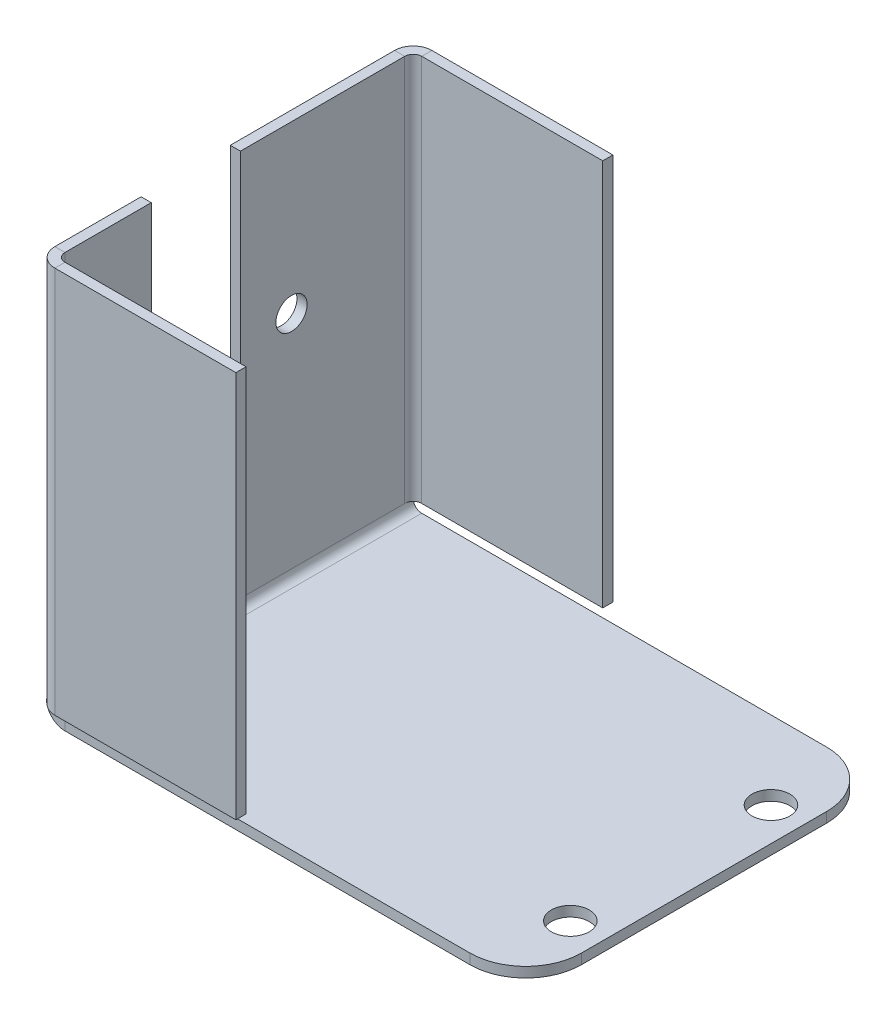
ISO-10303-21;
HEADER;
FILE_DESCRIPTION(('STEP AP214'),'2;1');
FILE_NAME('part.step','',(''),(''),'','','');
FILE_SCHEMA(('AUTOMOTIVE_DESIGN { 1 0 10303 214 1 1 1 1 }'));
ENDSEC;
DATA;
#1=APPLICATION_CONTEXT('core data for automotive mechanical design processes');
#2=APPLICATION_PROTOCOL_DEFINITION('international standard','automotive_design',2000,#1);
#3=PRODUCT_CONTEXT('',#1,'mechanical');
#4=PRODUCT('Part','Part','',(#3));
#5=PRODUCT_RELATED_PRODUCT_CATEGORY('part','',(#4));
#6=PRODUCT_DEFINITION_FORMATION('','',#4);
#7=PRODUCT_DEFINITION_CONTEXT('part definition',#1,'design');
#8=PRODUCT_DEFINITION('design','',#6,#7);
#9=PRODUCT_DEFINITION_SHAPE('','',#8);
#10=(LENGTH_UNIT() NAMED_UNIT(*) SI_UNIT(.MILLI.,.METRE.));
#11=(NAMED_UNIT(*) PLANE_ANGLE_UNIT() SI_UNIT($,.RADIAN.));
#12=(NAMED_UNIT(*) SI_UNIT($,.STERADIAN.) SOLID_ANGLE_UNIT());
#13=UNCERTAINTY_MEASURE_WITH_UNIT(LENGTH_MEASURE(1.E-05),#10,'distance_accuracy_value','');
#14=(GEOMETRIC_REPRESENTATION_CONTEXT(3) GLOBAL_UNCERTAINTY_ASSIGNED_CONTEXT((#13)) GLOBAL_UNIT_ASSIGNED_CONTEXT((#10,
#11,#12)) REPRESENTATION_CONTEXT('',''));
#15=CARTESIAN_POINT('',(0.,0.,0.));
#16=DIRECTION('',(0.,0.,1.));
#17=DIRECTION('',(1.,0.,0.));
#18=AXIS2_PLACEMENT_3D('',#15,#16,#17);
#19=CARTESIAN_POINT('',(0.,0.,0.));
#20=DIRECTION('',(1.,0.,0.));
#21=DIRECTION('',(0.,1.,0.));
#22=AXIS2_PLACEMENT_3D('',#19,#20,#21);
#23=PLANE('',#22);
#24=CARTESIAN_POINT('',(0.,20.6,-21.08));
#25=DIRECTION('',(-1.,0.,0.));
#26=DIRECTION('',(0.,-1.,0.));
#27=AXIS2_PLACEMENT_3D('',#24,#25,#26);
#28=CIRCLE('',#27,1.4);
#29=CARTESIAN_POINT('',(0.,19.2,-21.08));
#30=VERTEX_POINT('',#29);
#31=EDGE_CURVE('E400',#30,#30,#28,.T.);
#32=ORIENTED_EDGE('',*,*,#31,.F.);
#33=EDGE_LOOP('',(#32));
#34=FACE_BOUND('',#33,.T.);
#35=CARTESIAN_POINT('',(0.,7.22999999999999,-7.1));
#36=DIRECTION('',(-1.,0.,0.));
#37=DIRECTION('',(0.,-1.,0.));
#38=AXIS2_PLACEMENT_3D('',#35,#36,#37);
#39=CIRCLE('',#38,1.4);
#40=CARTESIAN_POINT('',(0.,5.82999999999999,-7.1));
#41=VERTEX_POINT('',#40);
#42=EDGE_CURVE('E391',#41,#41,#39,.T.);
#43=ORIENTED_EDGE('',*,*,#42,.F.);
#44=EDGE_LOOP('',(#43));
#45=FACE_BOUND('',#44,.T.);
#46=DIRECTION('',(0.,1.,0.));
#47=VECTOR('',#46,1.);
#48=CARTESIAN_POINT('',(0.,0.,-8.5));
#49=LINE('',#48,#47);
#50=CARTESIAN_POINT('',(-1.23947587528931E-13,35.5,-8.5));
#51=VERTEX_POINT('',#50);
#52=CARTESIAN_POINT('',(0.,15.,-8.5));
#53=VERTEX_POINT('',#52);
#54=EDGE_CURVE('E229',#51,#53,#49,.F.);
#55=ORIENTED_EDGE('',*,*,#54,.T.);
#56=CARTESIAN_POINT('',(0.,15.,-12.5));
#57=DIRECTION('',(-1.,0.,0.));
#58=DIRECTION('',(0.,-1.,0.));
#59=AXIS2_PLACEMENT_3D('',#56,#57,#58);
#60=CIRCLE('',#59,4.);
#61=CARTESIAN_POINT('',(0.,15.,-16.5));
#62=VERTEX_POINT('',#61);
#63=EDGE_CURVE('E244',#62,#53,#60,.T.);
#64=ORIENTED_EDGE('',*,*,#63,.F.);
#65=DIRECTION('',(0.,1.,0.));
#66=VECTOR('',#65,1.);
#67=CARTESIAN_POINT('',(0.,0.,-16.5));
#68=LINE('',#67,#66);
#69=CARTESIAN_POINT('',(-1.23947587528931E-13,35.5,-16.5));
#70=VERTEX_POINT('',#69);
#71=EDGE_CURVE('E247',#62,#70,#68,.T.);
#72=ORIENTED_EDGE('',*,*,#71,.T.);
#73=DIRECTION('',(0.,0.,-1.));
#74=VECTOR('',#73,1.);
#75=CARTESIAN_POINT('',(-1.23947587528931E-13,35.5,0.));
#76=LINE('',#75,#74);
#77=CARTESIAN_POINT('',(-1.23947587528931E-13,35.5,-31.238));
#78=VERTEX_POINT('',#77);
#79=EDGE_CURVE('E317',#70,#78,#76,.T.);
#80=ORIENTED_EDGE('',*,*,#79,.T.);
#81=DIRECTION('',(0.,1.,0.));
#82=VECTOR('',#81,1.);
#83=CARTESIAN_POINT('',(0.,35.5,-31.238));
#84=LINE('',#83,#82);
#85=CARTESIAN_POINT('',(0.,0.761999999999994,-31.238));
#86=VERTEX_POINT('',#85);
#87=EDGE_CURVE('E460',#78,#86,#84,.F.);
#88=ORIENTED_EDGE('',*,*,#87,.T.);
#89=DIRECTION('',(0.,0.,1.));
#90=VECTOR('',#89,1.);
#91=CARTESIAN_POINT('',(0.,0.761999999999994,-32.));
#92=LINE('',#91,#90);
#93=CARTESIAN_POINT('',(0.,0.761999999999994,-0.761999999999999));
#94=VERTEX_POINT('',#93);
#95=EDGE_CURVE('E325',#94,#86,#92,.F.);
#96=ORIENTED_EDGE('',*,*,#95,.F.);
#97=DIRECTION('',(0.,-1.,0.));
#98=VECTOR('',#97,1.);
#99=CARTESIAN_POINT('',(0.,0.761999999999996,-0.761999999999997));
#100=LINE('',#99,#98);
#101=CARTESIAN_POINT('',(-1.23924308315093E-13,35.5,-0.761999999999997));
#102=VERTEX_POINT('',#101);
#103=EDGE_CURVE('E291',#94,#102,#100,.F.);
#104=ORIENTED_EDGE('',*,*,#103,.T.);
#105=EDGE_CURVE('E246',#102,#51,#76,.T.);
#106=ORIENTED_EDGE('',*,*,#105,.T.);
#107=EDGE_LOOP('',(#55,#64,#72,#80,#88,#96,#104,#106));
#108=FACE_BOUND('',#107,.T.);
#109=ADVANCED_FACE('F58',(#34,#45,#108),#23,.F.);
#110=CARTESIAN_POINT('',(0.91,0.,0.));
#111=DIRECTION('',(1.,0.,0.));
#112=DIRECTION('',(0.,1.,0.));
#113=AXIS2_PLACEMENT_3D('',#110,#111,#112);
#114=PLANE('',#113);
#115=CARTESIAN_POINT('',(0.909999999999928,20.6,-21.08));
#116=DIRECTION('',(1.,0.,0.));
#117=DIRECTION('',(0.,1.,0.));
#118=AXIS2_PLACEMENT_3D('',#115,#116,#117);
#119=CIRCLE('',#118,1.4);
#120=CARTESIAN_POINT('',(0.909999999999923,22.,-21.08));
#121=VERTEX_POINT('',#120);
#122=EDGE_CURVE('E62',#121,#121,#119,.T.);
#123=ORIENTED_EDGE('',*,*,#122,.F.);
#124=EDGE_LOOP('',(#123));
#125=FACE_BOUND('',#124,.T.);
#126=CARTESIAN_POINT('',(0.909999999999973,7.23,-7.1));
#127=DIRECTION('',(1.,0.,0.));
#128=DIRECTION('',(0.,1.,0.));
#129=AXIS2_PLACEMENT_3D('',#126,#127,#128);
#130=CIRCLE('',#129,1.4);
#131=CARTESIAN_POINT('',(0.909999999999969,8.63,-7.1));
#132=VERTEX_POINT('',#131);
#133=EDGE_CURVE('E388',#132,#132,#130,.T.);
#134=ORIENTED_EDGE('',*,*,#133,.F.);
#135=EDGE_LOOP('',(#134));
#136=FACE_BOUND('',#135,.T.);
#137=CARTESIAN_POINT('',(0.909999999999947,15.,-12.5));
#138=DIRECTION('',(1.,0.,0.));
#139=DIRECTION('',(0.,1.,0.));
#140=AXIS2_PLACEMENT_3D('',#137,#138,#139);
#141=CIRCLE('',#140,4.);
#142=CARTESIAN_POINT('',(0.909999999999947,15.,-16.5));
#143=VERTEX_POINT('',#142);
#144=CARTESIAN_POINT('',(0.909999999999947,15.,-8.5));
#145=VERTEX_POINT('',#144);
#146=EDGE_CURVE('E251',#143,#145,#141,.F.);
#147=ORIENTED_EDGE('',*,*,#146,.T.);
#148=DIRECTION('',(0.,-1.,0.));
#149=VECTOR('',#148,1.);
#150=CARTESIAN_POINT('',(0.91,0.,-8.49999999999999));
#151=LINE('',#150,#149);
#152=CARTESIAN_POINT('',(0.909999999999876,35.5,-8.5));
#153=VERTEX_POINT('',#152);
#154=EDGE_CURVE('E232',#153,#145,#151,.T.);
#155=ORIENTED_EDGE('',*,*,#154,.F.);
#156=DIRECTION('',(0.,0.,1.));
#157=VECTOR('',#156,1.);
#158=CARTESIAN_POINT('',(0.909999999999876,35.5,-32.));
#159=LINE('',#158,#157);
#160=CARTESIAN_POINT('',(0.909999999999876,35.5,-0.761999999999999));
#161=VERTEX_POINT('',#160);
#162=EDGE_CURVE('E318',#161,#153,#159,.F.);
#163=ORIENTED_EDGE('',*,*,#162,.F.);
#164=DIRECTION('',(0.,-1.,0.));
#165=VECTOR('',#164,1.);
#166=CARTESIAN_POINT('',(0.909999999999993,0.762,-0.761999999999997));
#167=LINE('',#166,#165);
#168=CARTESIAN_POINT('',(0.909999999999993,0.762000000000031,-0.761999999999997));
#169=VERTEX_POINT('',#168);
#170=EDGE_CURVE('E304',#169,#161,#167,.F.);
#171=ORIENTED_EDGE('',*,*,#170,.F.);
#172=DIRECTION('',(0.,0.,1.));
#173=VECTOR('',#172,1.);
#174=CARTESIAN_POINT('',(0.909999999999997,0.761999999999997,-32.));
#175=LINE('',#174,#173);
#176=CARTESIAN_POINT('',(0.909999999999997,0.761999999999997,-31.238));
#177=VERTEX_POINT('',#176);
#178=EDGE_CURVE('E333',#177,#169,#175,.T.);
#179=ORIENTED_EDGE('',*,*,#178,.F.);
#180=DIRECTION('',(0.,1.,0.));
#181=VECTOR('',#180,1.);
#182=CARTESIAN_POINT('',(0.90999999999993,35.5,-31.238));
#183=LINE('',#182,#181);
#184=CARTESIAN_POINT('',(0.909999999999876,35.5,-31.238));
#185=VERTEX_POINT('',#184);
#186=EDGE_CURVE('E472',#185,#177,#183,.F.);
#187=ORIENTED_EDGE('',*,*,#186,.F.);
#188=CARTESIAN_POINT('',(0.909999999999876,35.5,-16.5));
#189=VERTEX_POINT('',#188);
#190=EDGE_CURVE('E321',#189,#185,#159,.F.);
#191=ORIENTED_EDGE('',*,*,#190,.F.);
#192=DIRECTION('',(0.,1.,0.));
#193=VECTOR('',#192,1.);
#194=CARTESIAN_POINT('',(0.91,0.,-16.5));
#195=LINE('',#194,#193);
#196=EDGE_CURVE('E390',#143,#189,#195,.T.);
#197=ORIENTED_EDGE('',*,*,#196,.F.);
#198=EDGE_LOOP('',(#147,#155,#163,#171,#179,#187,#191,#197));
#199=FACE_BOUND('',#198,.T.);
#200=ADVANCED_FACE('F530',(#125,#136,#199),#114,.T.);
#201=CARTESIAN_POINT('',(-1.23924308315093E-13,35.5,-32.));
#202=DIRECTION('',(0.,-1.,0.));
#203=DIRECTION('',(1.,0.,0.));
#204=AXIS2_PLACEMENT_3D('',#201,#202,#203);
#205=PLANE('',#204);
#206=DIRECTION('',(1.,0.,0.));
#207=VECTOR('',#206,1.);
#208=CARTESIAN_POINT('',(0.909999999999876,35.5,-8.5));
#209=LINE('',#208,#207);
#210=EDGE_CURVE('E237',#153,#51,#209,.F.);
#211=ORIENTED_EDGE('',*,*,#210,.T.);
#212=ORIENTED_EDGE('',*,*,#105,.F.);
#213=DIRECTION('',(-1.,0.,0.));
#214=VECTOR('',#213,1.);
#215=CARTESIAN_POINT('',(0.909999999999875,35.5,-0.761999999999997));
#216=LINE('',#215,#214);
#217=EDGE_CURVE('E297',#161,#102,#216,.T.);
#218=ORIENTED_EDGE('',*,*,#217,.F.);
#219=ORIENTED_EDGE('',*,*,#162,.T.);
#220=EDGE_LOOP('',(#211,#212,#218,#219));
#221=FACE_BOUND('',#220,.T.);
#222=ADVANCED_FACE('F536',(#221),#205,.F.);
#223=DIRECTION('',(1.,0.,0.));
#224=VECTOR('',#223,1.);
#225=CARTESIAN_POINT('',(0.909999999999876,35.5,-16.5));
#226=LINE('',#225,#224);
#227=EDGE_CURVE('E406',#189,#70,#226,.F.);
#228=ORIENTED_EDGE('',*,*,#227,.F.);
#229=ORIENTED_EDGE('',*,*,#190,.T.);
#230=DIRECTION('',(-1.,0.,0.));
#231=VECTOR('',#230,1.);
#232=CARTESIAN_POINT('',(0.90999999999993,35.5,-31.238));
#233=LINE('',#232,#231);
#234=EDGE_CURVE('E257',#185,#78,#233,.T.);
#235=ORIENTED_EDGE('',*,*,#234,.T.);
#236=ORIENTED_EDGE('',*,*,#79,.F.);
#237=EDGE_LOOP('',(#228,#229,#235,#236));
#238=FACE_BOUND('',#237,.T.);
#239=ADVANCED_FACE('F482',(#238),#205,.F.);
#240=CARTESIAN_POINT('',(12.2237084989847,15.,-12.5));
#241=DIRECTION('',(-1.,0.,0.));
#242=DIRECTION('',(0.,-1.,0.));
#243=AXIS2_PLACEMENT_3D('',#240,#241,#242);
#244=CYLINDRICAL_SURFACE('',#243,4.);
#245=DIRECTION('',(1.,0.,0.));
#246=VECTOR('',#245,1.);
#247=CARTESIAN_POINT('',(0.909999999999947,15.,-8.5));
#248=LINE('',#247,#246);
#249=EDGE_CURVE('E226',#145,#53,#248,.F.);
#250=ORIENTED_EDGE('',*,*,#249,.F.);
#251=ORIENTED_EDGE('',*,*,#146,.F.);
#252=DIRECTION('',(1.,0.,0.));
#253=VECTOR('',#252,1.);
#254=CARTESIAN_POINT('',(0.909999999999947,15.,-16.5));
#255=LINE('',#254,#253);
#256=EDGE_CURVE('E238',#143,#62,#255,.F.);
#257=ORIENTED_EDGE('',*,*,#256,.T.);
#258=ORIENTED_EDGE('',*,*,#63,.T.);
#259=EDGE_LOOP('',(#250,#251,#257,#258));
#260=FACE_BOUND('',#259,.T.);
#261=ADVANCED_FACE('F250',(#260),#244,.F.);
#262=CARTESIAN_POINT('',(0.910000000000048,0.761999999999999,-31.238));
#263=DIRECTION('',(0.,1.,0.));
#264=DIRECTION('',(-1.,0.,0.));
#265=AXIS2_PLACEMENT_3D('',#262,#263,#264);
#266=PLANE('',#265);
#267=DIRECTION('',(0.,0.,1.));
#268=VECTOR('',#267,1.);
#269=CARTESIAN_POINT('',(0.,0.762000000000067,0.));
#270=LINE('',#269,#268);
#271=CARTESIAN_POINT('',(-1.23924308315093E-13,0.761999999999994,-32.));
#272=VERTEX_POINT('',#271);
#273=EDGE_CURVE('E252',#86,#272,#270,.F.);
#274=ORIENTED_EDGE('',*,*,#273,.F.);
#275=CARTESIAN_POINT('',(1.67200000000005,0.761999999999999,-31.238));
#276=DIRECTION('',(0.,1.,0.));
#277=DIRECTION('',(-1.,0.,0.));
#278=AXIS2_PLACEMENT_3D('',#275,#276,#277);
#279=CIRCLE('',#278,1.672);
#280=CARTESIAN_POINT('',(0.183732550917051,0.761999999999994,-32.));
#281=VERTEX_POINT('',#280);
#282=EDGE_CURVE('E464',#86,#281,#279,.F.);
#283=ORIENTED_EDGE('',*,*,#282,.T.);
#284=DIRECTION('',(1.,0.,0.));
#285=VECTOR('',#284,1.);
#286=CARTESIAN_POINT('',(0.,0.761999999999994,-32.));
#287=LINE('',#286,#285);
#288=EDGE_CURVE('E314',#281,#272,#287,.F.);
#289=ORIENTED_EDGE('',*,*,#288,.T.);
#290=EDGE_LOOP('',(#274,#283,#289));
#291=FACE_BOUND('',#290,.T.);
#292=ADVANCED_FACE('F612',(#291),#266,.T.);
#293=CARTESIAN_POINT('',(0.909999999999997,0.761999999999997,0.));
#294=DIRECTION('',(0.,1.,0.));
#295=DIRECTION('',(0.,0.,1.));
#296=AXIS2_PLACEMENT_3D('',#293,#294,#295);
#297=PLANE('',#296);
#298=DIRECTION('',(1.,0.,0.));
#299=VECTOR('',#298,1.);
#300=CARTESIAN_POINT('',(0.909999999999997,0.761999999999997,0.));
#301=LINE('',#300,#299);
#302=CARTESIAN_POINT('',(0.183732550916999,0.761999999999995,0.));
#303=VERTEX_POINT('',#302);
#304=CARTESIAN_POINT('',(0.,0.761999999999994,0.));
#305=VERTEX_POINT('',#304);
#306=EDGE_CURVE('E329',#303,#305,#301,.F.);
#307=ORIENTED_EDGE('',*,*,#306,.F.);
#308=CARTESIAN_POINT('',(1.67199999999999,0.762000000000034,-0.761999999999997));
#309=DIRECTION('',(0.,-1.,0.));
#310=DIRECTION('',(1.,0.,0.));
#311=AXIS2_PLACEMENT_3D('',#308,#309,#310);
#312=CIRCLE('',#311,1.672);
#313=EDGE_CURVE('E301',#303,#94,#312,.T.);
#314=ORIENTED_EDGE('',*,*,#313,.T.);
#315=EDGE_CURVE('E322',#305,#94,#92,.F.);
#316=ORIENTED_EDGE('',*,*,#315,.F.);
#317=EDGE_LOOP('',(#307,#314,#316));
#318=FACE_BOUND('',#317,.T.);
#319=ADVANCED_FACE('F542',(#318),#297,.T.);
#320=CARTESIAN_POINT('',(0.,-0.91,0.));
#321=DIRECTION('',(0.,0.,1.));
#322=DIRECTION('',(1.,0.,0.));
#323=AXIS2_PLACEMENT_3D('',#320,#321,#322);
#324=PLANE('',#323);
#325=DIRECTION('',(1.,0.,0.));
#326=VECTOR('',#325,1.);
#327=CARTESIAN_POINT('',(0.,-0.91,0.));
#328=LINE('',#327,#326);
#329=CARTESIAN_POINT('',(1.672,-0.91,0.));
#330=VERTEX_POINT('',#329);
#331=CARTESIAN_POINT('',(38.,-0.91,0.));
#332=VERTEX_POINT('',#331);
#333=EDGE_CURVE('E361',#330,#332,#328,.T.);
#334=ORIENTED_EDGE('',*,*,#333,.T.);
#335=DIRECTION('',(0.,1.,0.));
#336=VECTOR('',#335,1.);
#337=CARTESIAN_POINT('',(38.,-0.91,0.));
#338=LINE('',#337,#336);
#339=CARTESIAN_POINT('',(38.,0.,0.));
#340=VERTEX_POINT('',#339);
#341=EDGE_CURVE('E375',#332,#340,#338,.T.);
#342=ORIENTED_EDGE('',*,*,#341,.T.);
#343=DIRECTION('',(1.,0.,0.));
#344=VECTOR('',#343,1.);
#345=CARTESIAN_POINT('',(0.,0.,0.));
#346=LINE('',#345,#344);
#347=CARTESIAN_POINT('',(1.672,0.,0.));
#348=VERTEX_POINT('',#347);
#349=EDGE_CURVE('E358',#348,#340,#346,.T.);
#350=ORIENTED_EDGE('',*,*,#349,.F.);
#351=DIRECTION('',(0.,-1.,0.));
#352=VECTOR('',#351,1.);
#353=CARTESIAN_POINT('',(1.672,0.,0.));
#354=LINE('',#353,#352);
#355=EDGE_CURVE('E344',#348,#330,#354,.T.);
#356=ORIENTED_EDGE('',*,*,#355,.T.);
#357=EDGE_LOOP('',(#334,#342,#350,#356));
#358=FACE_BOUND('',#357,.T.);
#359=ADVANCED_FACE('F570',(#358),#324,.T.);
#360=CARTESIAN_POINT('',(0.,-0.91,0.));
#361=DIRECTION('',(0.,-1.,0.));
#362=DIRECTION('',(0.,0.,-1.));
#363=AXIS2_PLACEMENT_3D('',#360,#361,#362);
#364=PLANE('',#363);
#365=CARTESIAN_POINT('',(40.,-0.91,-7.));
#366=DIRECTION('',(0.,-1.,0.));
#367=DIRECTION('',(0.,0.,-1.));
#368=AXIS2_PLACEMENT_3D('',#365,#366,#367);
#369=CIRCLE('',#368,1.69999999999999);
#370=CARTESIAN_POINT('',(40.,-0.91,-8.69999999999999));
#371=VERTEX_POINT('',#370);
#372=EDGE_CURVE('E412',#371,#371,#369,.T.);
#373=ORIENTED_EDGE('',*,*,#372,.F.);
#374=EDGE_LOOP('',(#373));
#375=FACE_BOUND('',#374,.T.);
#376=CARTESIAN_POINT('',(4.672,-0.91,-3.));
#377=DIRECTION('',(0.,-1.,0.));
#378=DIRECTION('',(0.,0.,-1.));
#379=AXIS2_PLACEMENT_3D('',#376,#377,#378);
#380=CIRCLE('',#379,1.69999999999999);
#381=CARTESIAN_POINT('',(4.672,-0.91,-4.69999999999999));
#382=VERTEX_POINT('',#381);
#383=EDGE_CURVE('E418',#382,#382,#380,.T.);
#384=ORIENTED_EDGE('',*,*,#383,.F.);
#385=EDGE_LOOP('',(#384));
#386=FACE_BOUND('',#385,.T.);
#387=CARTESIAN_POINT('',(40.,-0.91,-25.));
#388=DIRECTION('',(0.,-1.,0.));
#389=DIRECTION('',(0.,0.,-1.));
#390=AXIS2_PLACEMENT_3D('',#387,#388,#389);
#391=CIRCLE('',#390,1.69999999999999);
#392=CARTESIAN_POINT('',(40.,-0.91,-26.7));
#393=VERTEX_POINT('',#392);
#394=EDGE_CURVE('E424',#393,#393,#391,.T.);
#395=ORIENTED_EDGE('',*,*,#394,.F.);
#396=EDGE_LOOP('',(#395));
#397=FACE_BOUND('',#396,.T.);
#398=DIRECTION('',(0.,0.,-1.));
#399=VECTOR('',#398,1.);
#400=CARTESIAN_POINT('',(43.,-0.91,0.));
#401=LINE('',#400,#399);
#402=CARTESIAN_POINT('',(43.,-0.91,-5.));
#403=VERTEX_POINT('',#402);
#404=CARTESIAN_POINT('',(43.,-0.91,-27.));
#405=VERTEX_POINT('',#404);
#406=EDGE_CURVE('E364',#403,#405,#401,.T.);
#407=ORIENTED_EDGE('',*,*,#406,.F.);
#408=CARTESIAN_POINT('',(38.,-0.91,-5.));
#409=DIRECTION('',(0.,-1.,0.));
#410=DIRECTION('',(0.,0.,-1.));
#411=AXIS2_PLACEMENT_3D('',#408,#409,#410);
#412=CIRCLE('',#411,5.);
#413=EDGE_CURVE('E67',#403,#332,#412,.T.);
#414=ORIENTED_EDGE('',*,*,#413,.T.);
#415=ORIENTED_EDGE('',*,*,#333,.F.);
#416=DIRECTION('',(0.,0.,1.));
#417=VECTOR('',#416,1.);
#418=CARTESIAN_POINT('',(1.672,-0.91,0.));
#419=LINE('',#418,#417);
#420=CARTESIAN_POINT('',(1.672,-0.91,-32.));
#421=VERTEX_POINT('',#420);
#422=EDGE_CURVE('E337',#330,#421,#419,.F.);
#423=ORIENTED_EDGE('',*,*,#422,.T.);
#424=DIRECTION('',(-1.,0.,0.));
#425=VECTOR('',#424,1.);
#426=CARTESIAN_POINT('',(0.,-0.91,-32.));
#427=LINE('',#426,#425);
#428=CARTESIAN_POINT('',(38.,-0.91,-32.));
#429=VERTEX_POINT('',#428);
#430=EDGE_CURVE('E367',#429,#421,#427,.T.);
#431=ORIENTED_EDGE('',*,*,#430,.F.);
#432=CARTESIAN_POINT('',(38.,-0.91,-27.));
#433=DIRECTION('',(0.,-1.,0.));
#434=DIRECTION('',(0.,0.,-1.));
#435=AXIS2_PLACEMENT_3D('',#432,#433,#434);
#436=CIRCLE('',#435,5.);
#437=EDGE_CURVE('E80',#429,#405,#436,.T.);
#438=ORIENTED_EDGE('',*,*,#437,.T.);
#439=EDGE_LOOP('',(#407,#414,#415,#423,#431,#438));
#440=FACE_BOUND('',#439,.T.);
#441=ADVANCED_FACE('F566',(#375,#386,#397,#440),#364,.T.);
#442=CARTESIAN_POINT('',(0.,0.,0.));
#443=DIRECTION('',(0.,-1.,0.));
#444=DIRECTION('',(0.,0.,-1.));
#445=AXIS2_PLACEMENT_3D('',#442,#443,#444);
#446=PLANE('',#445);
#447=CARTESIAN_POINT('',(40.,0.,-7.));
#448=DIRECTION('',(0.,1.,0.));
#449=DIRECTION('',(0.,0.,1.));
#450=AXIS2_PLACEMENT_3D('',#447,#448,#449);
#451=CIRCLE('',#450,1.69999999999999);
#452=CARTESIAN_POINT('',(40.,0.,-5.30000000000001));
#453=VERTEX_POINT('',#452);
#454=EDGE_CURVE('E408',#453,#453,#451,.T.);
#455=ORIENTED_EDGE('',*,*,#454,.F.);
#456=EDGE_LOOP('',(#455));
#457=FACE_BOUND('',#456,.T.);
#458=CARTESIAN_POINT('',(4.672,0.,-3.));
#459=DIRECTION('',(0.,1.,0.));
#460=DIRECTION('',(0.,0.,1.));
#461=AXIS2_PLACEMENT_3D('',#458,#459,#460);
#462=CIRCLE('',#461,1.69999999999999);
#463=CARTESIAN_POINT('',(4.672,0.,-1.30000000000001));
#464=VERTEX_POINT('',#463);
#465=EDGE_CURVE('E415',#464,#464,#462,.T.);
#466=ORIENTED_EDGE('',*,*,#465,.F.);
#467=EDGE_LOOP('',(#466));
#468=FACE_BOUND('',#467,.T.);
#469=CARTESIAN_POINT('',(40.,0.,-25.));
#470=DIRECTION('',(0.,1.,0.));
#471=DIRECTION('',(0.,0.,1.));
#472=AXIS2_PLACEMENT_3D('',#469,#470,#471);
#473=CIRCLE('',#472,1.69999999999999);
#474=CARTESIAN_POINT('',(40.,0.,-23.3));
#475=VERTEX_POINT('',#474);
#476=EDGE_CURVE('E421',#475,#475,#473,.T.);
#477=ORIENTED_EDGE('',*,*,#476,.F.);
#478=EDGE_LOOP('',(#477));
#479=FACE_BOUND('',#478,.T.);
#480=ORIENTED_EDGE('',*,*,#349,.T.);
#481=CARTESIAN_POINT('',(38.,0.,-5.));
#482=DIRECTION('',(0.,-1.,0.));
#483=DIRECTION('',(0.,0.,-1.));
#484=AXIS2_PLACEMENT_3D('',#481,#482,#483);
#485=CIRCLE('',#484,5.);
#486=CARTESIAN_POINT('',(43.,0.,-5.));
#487=VERTEX_POINT('',#486);
#488=EDGE_CURVE('E380',#340,#487,#485,.F.);
#489=ORIENTED_EDGE('',*,*,#488,.T.);
#490=DIRECTION('',(0.,0.,-1.));
#491=VECTOR('',#490,1.);
#492=CARTESIAN_POINT('',(43.,0.,0.));
#493=LINE('',#492,#491);
#494=CARTESIAN_POINT('',(43.,0.,-27.));
#495=VERTEX_POINT('',#494);
#496=EDGE_CURVE('E371',#487,#495,#493,.T.);
#497=ORIENTED_EDGE('',*,*,#496,.T.);
#498=CARTESIAN_POINT('',(38.,0.,-27.));
#499=DIRECTION('',(0.,-1.,0.));
#500=DIRECTION('',(0.,0.,-1.));
#501=AXIS2_PLACEMENT_3D('',#498,#499,#500);
#502=CIRCLE('',#501,5.);
#503=CARTESIAN_POINT('',(38.,0.,-32.));
#504=VERTEX_POINT('',#503);
#505=EDGE_CURVE('E378',#495,#504,#502,.F.);
#506=ORIENTED_EDGE('',*,*,#505,.T.);
#507=DIRECTION('',(-1.,0.,0.));
#508=VECTOR('',#507,1.);
#509=CARTESIAN_POINT('',(0.,0.,-32.));
#510=LINE('',#509,#508);
#511=CARTESIAN_POINT('',(1.672,0.,-32.));
#512=VERTEX_POINT('',#511);
#513=EDGE_CURVE('E365',#504,#512,#510,.T.);
#514=ORIENTED_EDGE('',*,*,#513,.T.);
#515=DIRECTION('',(0.,0.,1.));
#516=VECTOR('',#515,1.);
#517=CARTESIAN_POINT('',(1.672,0.,0.));
#518=LINE('',#517,#516);
#519=EDGE_CURVE('E350',#348,#512,#518,.F.);
#520=ORIENTED_EDGE('',*,*,#519,.F.);
#521=EDGE_LOOP('',(#480,#489,#497,#506,#514,#520));
#522=FACE_BOUND('',#521,.T.);
#523=ADVANCED_FACE('F569',(#457,#468,#479,#522),#446,.F.);
#524=CARTESIAN_POINT('',(0.,-0.91,-32.));
#525=DIRECTION('',(0.,0.,-1.));
#526=DIRECTION('',(-1.,0.,0.));
#527=AXIS2_PLACEMENT_3D('',#524,#525,#526);
#528=PLANE('',#527);
#529=ORIENTED_EDGE('',*,*,#513,.F.);
#530=DIRECTION('',(0.,1.,0.));
#531=VECTOR('',#530,1.);
#532=CARTESIAN_POINT('',(38.,-0.91,-32.));
#533=LINE('',#532,#531);
#534=EDGE_CURVE('E13',#504,#429,#533,.F.);
#535=ORIENTED_EDGE('',*,*,#534,.T.);
#536=ORIENTED_EDGE('',*,*,#430,.T.);
#537=DIRECTION('',(0.,-1.,0.));
#538=VECTOR('',#537,1.);
#539=CARTESIAN_POINT('',(1.672,0.,-32.));
#540=LINE('',#539,#538);
#541=EDGE_CURVE('E355',#512,#421,#540,.T.);
#542=ORIENTED_EDGE('',*,*,#541,.F.);
#543=EDGE_LOOP('',(#529,#535,#536,#542));
#544=FACE_BOUND('',#543,.T.);
#545=ADVANCED_FACE('F574',(#544),#528,.T.);
#546=CARTESIAN_POINT('',(43.,-0.91,0.));
#547=DIRECTION('',(1.,0.,0.));
#548=DIRECTION('',(0.,0.,-1.));
#549=AXIS2_PLACEMENT_3D('',#546,#547,#548);
#550=PLANE('',#549);
#551=ORIENTED_EDGE('',*,*,#496,.F.);
#552=DIRECTION('',(0.,1.,0.));
#553=VECTOR('',#552,1.);
#554=CARTESIAN_POINT('',(43.,-0.91,-5.));
#555=LINE('',#554,#553);
#556=EDGE_CURVE('E385',#487,#403,#555,.F.);
#557=ORIENTED_EDGE('',*,*,#556,.T.);
#558=ORIENTED_EDGE('',*,*,#406,.T.);
#559=DIRECTION('',(0.,1.,0.));
#560=VECTOR('',#559,1.);
#561=CARTESIAN_POINT('',(43.,-0.91,-27.));
#562=LINE('',#561,#560);
#563=EDGE_CURVE('E382',#405,#495,#562,.T.);
#564=ORIENTED_EDGE('',*,*,#563,.T.);
#565=EDGE_LOOP('',(#551,#557,#558,#564));
#566=FACE_BOUND('',#565,.T.);
#567=ADVANCED_FACE('F561',(#566),#550,.T.);
#568=CARTESIAN_POINT('',(1.672,0.762,-32.));
#569=DIRECTION('',(0.,0.,-1.));
#570=DIRECTION('',(-1.,0.,0.));
#571=AXIS2_PLACEMENT_3D('',#568,#569,#570);
#572=PLANE('',#571);
#573=CARTESIAN_POINT('',(0.909999999999997,0.761999999999997,-32.));
#574=VERTEX_POINT('',#573);
#575=EDGE_CURVE('E334',#574,#281,#287,.F.);
#576=ORIENTED_EDGE('',*,*,#575,.F.);
#577=CARTESIAN_POINT('',(1.672,0.762,-32.));
#578=DIRECTION('',(0.,0.,1.));
#579=DIRECTION('',(1.,0.,0.));
#580=AXIS2_PLACEMENT_3D('',#577,#578,#579);
#581=CIRCLE('',#580,0.762);
#582=EDGE_CURVE('E347',#512,#574,#581,.F.);
#583=ORIENTED_EDGE('',*,*,#582,.F.);
#584=ORIENTED_EDGE('',*,*,#541,.T.);
#585=CARTESIAN_POINT('',(1.672,0.762,-32.));
#586=DIRECTION('',(0.,0.,1.));
#587=DIRECTION('',(1.,0.,0.));
#588=AXIS2_PLACEMENT_3D('',#585,#586,#587);
#589=CIRCLE('',#588,1.672);
#590=EDGE_CURVE('E340',#421,#272,#589,.F.);
#591=ORIENTED_EDGE('',*,*,#590,.T.);
#592=ORIENTED_EDGE('',*,*,#288,.F.);
#593=EDGE_LOOP('',(#576,#583,#584,#591,#592));
#594=FACE_BOUND('',#593,.T.);
#595=ADVANCED_FACE('F558',(#594),#572,.T.);
#596=CARTESIAN_POINT('',(1.672,0.762,0.));
#597=DIRECTION('',(0.,0.,-1.));
#598=DIRECTION('',(-1.,0.,0.));
#599=AXIS2_PLACEMENT_3D('',#596,#597,#598);
#600=PLANE('',#599);
#601=CARTESIAN_POINT('',(1.672,0.762,0.));
#602=DIRECTION('',(0.,0.,1.));
#603=DIRECTION('',(1.,0.,0.));
#604=AXIS2_PLACEMENT_3D('',#601,#602,#603);
#605=CIRCLE('',#604,0.762);
#606=CARTESIAN_POINT('',(0.909999999999997,0.761999999999997,0.));
#607=VERTEX_POINT('',#606);
#608=EDGE_CURVE('E316',#607,#348,#605,.T.);
#609=ORIENTED_EDGE('',*,*,#608,.F.);
#610=EDGE_CURVE('E326',#607,#303,#301,.F.);
#611=ORIENTED_EDGE('',*,*,#610,.T.);
#612=ORIENTED_EDGE('',*,*,#306,.T.);
#613=CARTESIAN_POINT('',(1.672,0.762,0.));
#614=DIRECTION('',(0.,0.,1.));
#615=DIRECTION('',(1.,0.,0.));
#616=AXIS2_PLACEMENT_3D('',#613,#614,#615);
#617=CIRCLE('',#616,1.672);
#618=EDGE_CURVE('E341',#305,#330,#617,.T.);
#619=ORIENTED_EDGE('',*,*,#618,.T.);
#620=ORIENTED_EDGE('',*,*,#355,.F.);
#621=EDGE_LOOP('',(#609,#611,#612,#619,#620));
#622=FACE_BOUND('',#621,.T.);
#623=ADVANCED_FACE('F552',(#622),#600,.F.);
#624=CARTESIAN_POINT('',(1.672,0.762,0.));
#625=DIRECTION('',(0.,0.,1.));
#626=DIRECTION('',(-1.,0.,0.));
#627=AXIS2_PLACEMENT_3D('',#624,#625,#626);
#628=CYLINDRICAL_SURFACE('',#627,1.672);
#629=ORIENTED_EDGE('',*,*,#422,.F.);
#630=ORIENTED_EDGE('',*,*,#618,.F.);
#631=ORIENTED_EDGE('',*,*,#315,.T.);
#632=ORIENTED_EDGE('',*,*,#95,.T.);
#633=ORIENTED_EDGE('',*,*,#273,.T.);
#634=ORIENTED_EDGE('',*,*,#590,.F.);
#635=EDGE_LOOP('',(#629,#630,#631,#632,#633,#634));
#636=FACE_BOUND('',#635,.T.);
#637=ADVANCED_FACE('F548',(#636),#628,.T.);
#638=CARTESIAN_POINT('',(1.672,0.762,0.));
#639=DIRECTION('',(0.,0.,1.));
#640=DIRECTION('',(-1.,0.,0.));
#641=AXIS2_PLACEMENT_3D('',#638,#639,#640);
#642=CYLINDRICAL_SURFACE('',#641,0.762);
#643=ORIENTED_EDGE('',*,*,#519,.T.);
#644=ORIENTED_EDGE('',*,*,#582,.T.);
#645=EDGE_CURVE('E330',#574,#177,#175,.T.);
#646=ORIENTED_EDGE('',*,*,#645,.T.);
#647=ORIENTED_EDGE('',*,*,#178,.T.);
#648=DIRECTION('',(0.,0.,-1.));
#649=VECTOR('',#648,1.);
#650=CARTESIAN_POINT('',(0.909999999999997,0.761999999999997,0.));
#651=LINE('',#650,#649);
#652=EDGE_CURVE('E311',#607,#169,#651,.T.);
#653=ORIENTED_EDGE('',*,*,#652,.F.);
#654=ORIENTED_EDGE('',*,*,#608,.T.);
#655=EDGE_LOOP('',(#643,#644,#646,#647,#653,#654));
#656=FACE_BOUND('',#655,.T.);
#657=ADVANCED_FACE('F551',(#656),#642,.F.);
#658=CARTESIAN_POINT('',(1.67199999999999,0.762000000000034,-0.761999999999997));
#659=DIRECTION('',(0.,1.,0.));
#660=DIRECTION('',(-1.,0.,0.));
#661=AXIS2_PLACEMENT_3D('',#658,#659,#660);
#662=PLANE('',#661);
#663=ORIENTED_EDGE('',*,*,#610,.F.);
#664=ORIENTED_EDGE('',*,*,#652,.T.);
#665=CARTESIAN_POINT('',(1.67199999999999,0.762000000000034,-0.761999999999997));
#666=DIRECTION('',(0.,-1.,0.));
#667=DIRECTION('',(1.,0.,0.));
#668=AXIS2_PLACEMENT_3D('',#665,#666,#667);
#669=CIRCLE('',#668,0.762);
#670=CARTESIAN_POINT('',(1.67199999999999,0.762000000000034,0.));
#671=VERTEX_POINT('',#670);
#672=EDGE_CURVE('E290',#671,#169,#669,.T.);
#673=ORIENTED_EDGE('',*,*,#672,.F.);
#674=DIRECTION('',(0.,0.,1.));
#675=VECTOR('',#674,1.);
#676=CARTESIAN_POINT('',(1.67199999999999,0.762000000000034,0.));
#677=LINE('',#676,#675);
#678=CARTESIAN_POINT('',(1.67199999999999,0.762000000000034,0.910000000000003));
#679=VERTEX_POINT('',#678);
#680=EDGE_CURVE('E263',#671,#679,#677,.T.);
#681=ORIENTED_EDGE('',*,*,#680,.T.);
#682=EDGE_CURVE('E294',#679,#303,#312,.T.);
#683=ORIENTED_EDGE('',*,*,#682,.T.);
#684=EDGE_LOOP('',(#663,#664,#673,#681,#683));
#685=FACE_BOUND('',#684,.T.);
#686=ADVANCED_FACE('F556',(#685),#662,.F.);
#687=CARTESIAN_POINT('',(1.67199999999987,35.5,-0.761999999999997));
#688=DIRECTION('',(0.,1.,0.));
#689=DIRECTION('',(-1.,0.,0.));
#690=AXIS2_PLACEMENT_3D('',#687,#688,#689);
#691=PLANE('',#690);
#692=DIRECTION('',(0.,0.,1.));
#693=VECTOR('',#692,1.);
#694=CARTESIAN_POINT('',(1.67199999999987,35.5,0.));
#695=LINE('',#694,#693);
#696=CARTESIAN_POINT('',(1.67199999999987,35.5,0.));
#697=VERTEX_POINT('',#696);
#698=CARTESIAN_POINT('',(1.67199999999987,35.5,0.910000000000003));
#699=VERTEX_POINT('',#698);
#700=EDGE_CURVE('E254',#697,#699,#695,.T.);
#701=ORIENTED_EDGE('',*,*,#700,.F.);
#702=CARTESIAN_POINT('',(1.67199999999987,35.5,-0.761999999999997));
#703=DIRECTION('',(0.,-1.,0.));
#704=DIRECTION('',(1.,0.,0.));
#705=AXIS2_PLACEMENT_3D('',#702,#703,#704);
#706=CIRCLE('',#705,0.762);
#707=EDGE_CURVE('E300',#161,#697,#706,.F.);
#708=ORIENTED_EDGE('',*,*,#707,.F.);
#709=ORIENTED_EDGE('',*,*,#217,.T.);
#710=CARTESIAN_POINT('',(1.67199999999987,35.5,-0.761999999999997));
#711=DIRECTION('',(0.,-1.,0.));
#712=DIRECTION('',(1.,0.,0.));
#713=AXIS2_PLACEMENT_3D('',#710,#711,#712);
#714=CIRCLE('',#713,1.672);
#715=EDGE_CURVE('E293',#102,#699,#714,.F.);
#716=ORIENTED_EDGE('',*,*,#715,.T.);
#717=EDGE_LOOP('',(#701,#708,#709,#716));
#718=FACE_BOUND('',#717,.T.);
#719=ADVANCED_FACE('F648',(#718),#691,.T.);
#720=CARTESIAN_POINT('',(1.67199999999999,0.762000000000002,-0.761999999999997));
#721=DIRECTION('',(0.,-1.,0.));
#722=DIRECTION('',(0.,0.,1.));
#723=AXIS2_PLACEMENT_3D('',#720,#721,#722);
#724=CYLINDRICAL_SURFACE('',#723,1.672);
#725=ORIENTED_EDGE('',*,*,#103,.F.);
#726=ORIENTED_EDGE('',*,*,#313,.F.);
#727=ORIENTED_EDGE('',*,*,#682,.F.);
#728=DIRECTION('',(0.,1.,0.));
#729=VECTOR('',#728,1.);
#730=CARTESIAN_POINT('',(1.672,0.,0.910000000000003));
#731=LINE('',#730,#729);
#732=EDGE_CURVE('E266',#679,#699,#731,.T.);
#733=ORIENTED_EDGE('',*,*,#732,.T.);
#734=ORIENTED_EDGE('',*,*,#715,.F.);
#735=EDGE_LOOP('',(#725,#726,#727,#733,#734));
#736=FACE_BOUND('',#735,.T.);
#737=ADVANCED_FACE('F645',(#736),#724,.T.);
#738=CARTESIAN_POINT('',(1.67199999999999,0.762000000000002,-0.761999999999997));
#739=DIRECTION('',(0.,-1.,0.));
#740=DIRECTION('',(0.,0.,1.));
#741=AXIS2_PLACEMENT_3D('',#738,#739,#740);
#742=CYLINDRICAL_SURFACE('',#741,0.762);
#743=ORIENTED_EDGE('',*,*,#170,.T.);
#744=ORIENTED_EDGE('',*,*,#707,.T.);
#745=DIRECTION('',(0.,-1.,0.));
#746=VECTOR('',#745,1.);
#747=CARTESIAN_POINT('',(1.67199999999987,35.5,0.));
#748=LINE('',#747,#746);
#749=EDGE_CURVE('E261',#697,#671,#748,.T.);
#750=ORIENTED_EDGE('',*,*,#749,.T.);
#751=ORIENTED_EDGE('',*,*,#672,.T.);
#752=EDGE_LOOP('',(#743,#744,#750,#751));
#753=FACE_BOUND('',#752,.T.);
#754=ADVANCED_FACE('F621',(#753),#742,.F.);
#755=CARTESIAN_POINT('',(17.91,0.762000000000068,0.910000000000059));
#756=DIRECTION('',(0.,1.,0.));
#757=DIRECTION('',(-1.,0.,0.));
#758=AXIS2_PLACEMENT_3D('',#755,#756,#757);
#759=PLANE('',#758);
#760=ORIENTED_EDGE('',*,*,#680,.F.);
#761=DIRECTION('',(1.,0.,0.));
#762=VECTOR('',#761,1.);
#763=CARTESIAN_POINT('',(17.91,0.762000000000068,0.));
#764=LINE('',#763,#762);
#765=CARTESIAN_POINT('',(17.91,0.762000000000068,0.));
#766=VERTEX_POINT('',#765);
#767=EDGE_CURVE('E270',#671,#766,#764,.T.);
#768=ORIENTED_EDGE('',*,*,#767,.T.);
#769=DIRECTION('',(0.,0.,-1.));
#770=VECTOR('',#769,1.);
#771=CARTESIAN_POINT('',(17.91,0.762000000000068,0.910000000000059));
#772=LINE('',#771,#770);
#773=CARTESIAN_POINT('',(17.91,0.762000000000068,0.910000000000059));
#774=VERTEX_POINT('',#773);
#775=EDGE_CURVE('E287',#774,#766,#772,.T.);
#776=ORIENTED_EDGE('',*,*,#775,.F.);
#777=DIRECTION('',(1.,0.,0.));
#778=VECTOR('',#777,1.);
#779=CARTESIAN_POINT('',(17.91,0.762000000000068,0.910000000000059));
#780=LINE('',#779,#778);
#781=EDGE_CURVE('E271',#679,#774,#780,.T.);
#782=ORIENTED_EDGE('',*,*,#781,.F.);
#783=EDGE_LOOP('',(#760,#768,#776,#782));
#784=FACE_BOUND('',#783,.T.);
#785=ADVANCED_FACE('F638',(#784),#759,.F.);
#786=CARTESIAN_POINT('',(0.909999999999873,35.5,0.91));
#787=DIRECTION('',(0.,-1.,0.));
#788=DIRECTION('',(1.,0.,0.));
#789=AXIS2_PLACEMENT_3D('',#786,#787,#788);
#790=PLANE('',#789);
#791=ORIENTED_EDGE('',*,*,#700,.T.);
#792=DIRECTION('',(-1.,0.,0.));
#793=VECTOR('',#792,1.);
#794=CARTESIAN_POINT('',(0.909999999999873,35.5,0.91));
#795=LINE('',#794,#793);
#796=CARTESIAN_POINT('',(17.9099999999999,35.5,0.910000000000059));
#797=VERTEX_POINT('',#796);
#798=EDGE_CURVE('E276',#797,#699,#795,.T.);
#799=ORIENTED_EDGE('',*,*,#798,.F.);
#800=DIRECTION('',(0.,0.,-1.));
#801=VECTOR('',#800,1.);
#802=CARTESIAN_POINT('',(17.9099999999999,35.5,0.910000000000059));
#803=LINE('',#802,#801);
#804=CARTESIAN_POINT('',(17.9099999999999,35.5,0.));
#805=VERTEX_POINT('',#804);
#806=EDGE_CURVE('E279',#797,#805,#803,.T.);
#807=ORIENTED_EDGE('',*,*,#806,.T.);
#808=DIRECTION('',(-1.,0.,0.));
#809=VECTOR('',#808,1.);
#810=CARTESIAN_POINT('',(0.909999999999876,35.5,0.));
#811=LINE('',#810,#809);
#812=EDGE_CURVE('E274',#805,#697,#811,.T.);
#813=ORIENTED_EDGE('',*,*,#812,.T.);
#814=EDGE_LOOP('',(#791,#799,#807,#813));
#815=FACE_BOUND('',#814,.T.);
#816=ADVANCED_FACE('F629',(#815),#790,.F.);
#817=CARTESIAN_POINT('',(0.,0.,0.909999999999997));
#818=DIRECTION('',(0.,0.,-1.));
#819=DIRECTION('',(-1.,0.,0.));
#820=AXIS2_PLACEMENT_3D('',#817,#818,#819);
#821=PLANE('',#820);
#822=ORIENTED_EDGE('',*,*,#732,.F.);
#823=ORIENTED_EDGE('',*,*,#781,.T.);
#824=DIRECTION('',(0.,1.,0.));
#825=VECTOR('',#824,1.);
#826=CARTESIAN_POINT('',(17.9099999999999,35.5,0.910000000000059));
#827=LINE('',#826,#825);
#828=EDGE_CURVE('E273',#774,#797,#827,.T.);
#829=ORIENTED_EDGE('',*,*,#828,.T.);
#830=ORIENTED_EDGE('',*,*,#798,.T.);
#831=EDGE_LOOP('',(#822,#823,#829,#830));
#832=FACE_BOUND('',#831,.T.);
#833=ADVANCED_FACE('F641',(#832),#821,.F.);
#834=CARTESIAN_POINT('',(0.,0.,0.));
#835=DIRECTION('',(0.,0.,-1.));
#836=DIRECTION('',(-1.,0.,0.));
#837=AXIS2_PLACEMENT_3D('',#834,#835,#836);
#838=PLANE('',#837);
#839=ORIENTED_EDGE('',*,*,#767,.F.);
#840=ORIENTED_EDGE('',*,*,#749,.F.);
#841=ORIENTED_EDGE('',*,*,#812,.F.);
#842=DIRECTION('',(0.,1.,0.));
#843=VECTOR('',#842,1.);
#844=CARTESIAN_POINT('',(17.9099999999999,35.5,0.));
#845=LINE('',#844,#843);
#846=EDGE_CURVE('E281',#766,#805,#845,.T.);
#847=ORIENTED_EDGE('',*,*,#846,.F.);
#848=EDGE_LOOP('',(#839,#840,#841,#847));
#849=FACE_BOUND('',#848,.T.);
#850=ADVANCED_FACE('F626',(#849),#838,.T.);
#851=CARTESIAN_POINT('',(17.9099999999999,35.5,0.910000000000059));
#852=DIRECTION('',(-1.,0.,0.));
#853=DIRECTION('',(0.,-1.,0.));
#854=AXIS2_PLACEMENT_3D('',#851,#852,#853);
#855=PLANE('',#854);
#856=ORIENTED_EDGE('',*,*,#846,.T.);
#857=ORIENTED_EDGE('',*,*,#806,.F.);
#858=ORIENTED_EDGE('',*,*,#828,.F.);
#859=ORIENTED_EDGE('',*,*,#775,.T.);
#860=EDGE_LOOP('',(#856,#857,#858,#859));
#861=FACE_BOUND('',#860,.T.);
#862=ADVANCED_FACE('F634',(#861),#855,.F.);
#863=CARTESIAN_POINT('',(1.67200000000005,0.761999999999999,-31.238));
#864=DIRECTION('',(0.,-1.,0.));
#865=DIRECTION('',(1.,0.,0.));
#866=AXIS2_PLACEMENT_3D('',#863,#864,#865);
#867=PLANE('',#866);
#868=ORIENTED_EDGE('',*,*,#645,.F.);
#869=ORIENTED_EDGE('',*,*,#575,.T.);
#870=CARTESIAN_POINT('',(1.67200000000005,0.761999999999999,-32.91));
#871=VERTEX_POINT('',#870);
#872=EDGE_CURVE('E462',#281,#871,#279,.F.);
#873=ORIENTED_EDGE('',*,*,#872,.T.);
#874=DIRECTION('',(0.,0.,-1.));
#875=VECTOR('',#874,1.);
#876=CARTESIAN_POINT('',(1.67200000000005,0.762000000000032,-32.));
#877=LINE('',#876,#875);
#878=CARTESIAN_POINT('',(1.67200000000005,0.761999999999999,-32.));
#879=VERTEX_POINT('',#878);
#880=EDGE_CURVE('E427',#879,#871,#877,.T.);
#881=ORIENTED_EDGE('',*,*,#880,.F.);
#882=CARTESIAN_POINT('',(1.67200000000005,0.761999999999999,-31.238));
#883=DIRECTION('',(0.,1.,0.));
#884=DIRECTION('',(-1.,0.,0.));
#885=AXIS2_PLACEMENT_3D('',#882,#883,#884);
#886=CIRCLE('',#885,0.761999999999999);
#887=EDGE_CURVE('E469',#177,#879,#886,.F.);
#888=ORIENTED_EDGE('',*,*,#887,.F.);
#889=EDGE_LOOP('',(#868,#869,#873,#881,#888));
#890=FACE_BOUND('',#889,.T.);
#891=ADVANCED_FACE('F514',(#890),#867,.T.);
#892=CARTESIAN_POINT('',(1.67199999999993,35.5,-31.238));
#893=DIRECTION('',(0.,-1.,0.));
#894=DIRECTION('',(1.,0.,0.));
#895=AXIS2_PLACEMENT_3D('',#892,#893,#894);
#896=PLANE('',#895);
#897=CARTESIAN_POINT('',(1.67199999999993,35.5,-31.238));
#898=DIRECTION('',(0.,1.,0.));
#899=DIRECTION('',(-1.,0.,0.));
#900=AXIS2_PLACEMENT_3D('',#897,#898,#899);
#901=CIRCLE('',#900,0.761999999999999);
#902=CARTESIAN_POINT('',(1.67199999999993,35.5,-32.));
#903=VERTEX_POINT('',#902);
#904=EDGE_CURVE('E459',#903,#185,#901,.T.);
#905=ORIENTED_EDGE('',*,*,#904,.F.);
#906=DIRECTION('',(0.,0.,-1.));
#907=VECTOR('',#906,1.);
#908=CARTESIAN_POINT('',(1.67199999999993,35.5,-32.));
#909=LINE('',#908,#907);
#910=CARTESIAN_POINT('',(1.67199999999993,35.5,-32.91));
#911=VERTEX_POINT('',#910);
#912=EDGE_CURVE('E430',#903,#911,#909,.T.);
#913=ORIENTED_EDGE('',*,*,#912,.T.);
#914=CARTESIAN_POINT('',(1.67199999999993,35.5,-31.238));
#915=DIRECTION('',(0.,1.,0.));
#916=DIRECTION('',(-1.,0.,0.));
#917=AXIS2_PLACEMENT_3D('',#914,#915,#916);
#918=CIRCLE('',#917,1.672);
#919=EDGE_CURVE('E463',#911,#78,#918,.T.);
#920=ORIENTED_EDGE('',*,*,#919,.T.);
#921=ORIENTED_EDGE('',*,*,#234,.F.);
#922=EDGE_LOOP('',(#905,#913,#920,#921));
#923=FACE_BOUND('',#922,.T.);
#924=ADVANCED_FACE('F493',(#923),#896,.F.);
#925=CARTESIAN_POINT('',(1.67199999999993,35.5,-31.238));
#926=DIRECTION('',(0.,1.,0.));
#927=DIRECTION('',(0.,0.,-1.));
#928=AXIS2_PLACEMENT_3D('',#925,#926,#927);
#929=CYLINDRICAL_SURFACE('',#928,1.672);
#930=ORIENTED_EDGE('',*,*,#87,.F.);
#931=ORIENTED_EDGE('',*,*,#919,.F.);
#932=DIRECTION('',(0.,-1.,0.));
#933=VECTOR('',#932,1.);
#934=CARTESIAN_POINT('',(1.67200000000005,0.,-32.91));
#935=LINE('',#934,#933);
#936=EDGE_CURVE('E433',#911,#871,#935,.T.);
#937=ORIENTED_EDGE('',*,*,#936,.T.);
#938=ORIENTED_EDGE('',*,*,#872,.F.);
#939=ORIENTED_EDGE('',*,*,#282,.F.);
#940=EDGE_LOOP('',(#930,#931,#937,#938,#939));
#941=FACE_BOUND('',#940,.T.);
#942=ADVANCED_FACE('F489',(#941),#929,.T.);
#943=CARTESIAN_POINT('',(1.67199999999993,35.5,-31.238));
#944=DIRECTION('',(0.,1.,0.));
#945=DIRECTION('',(0.,0.,-1.));
#946=AXIS2_PLACEMENT_3D('',#943,#944,#945);
#947=CYLINDRICAL_SURFACE('',#946,0.761999999999999);
#948=ORIENTED_EDGE('',*,*,#186,.T.);
#949=ORIENTED_EDGE('',*,*,#887,.T.);
#950=DIRECTION('',(0.,1.,0.));
#951=VECTOR('',#950,1.);
#952=CARTESIAN_POINT('',(1.67200000000005,0.762000000000032,-32.));
#953=LINE('',#952,#951);
#954=EDGE_CURVE('E428',#879,#903,#953,.T.);
#955=ORIENTED_EDGE('',*,*,#954,.T.);
#956=ORIENTED_EDGE('',*,*,#904,.T.);
#957=EDGE_LOOP('',(#948,#949,#955,#956));
#958=FACE_BOUND('',#957,.T.);
#959=ADVANCED_FACE('F517',(#958),#947,.F.);
#960=CARTESIAN_POINT('',(17.9100000000001,0.762000000000068,-32.91));
#961=DIRECTION('',(0.,-1.,0.));
#962=DIRECTION('',(1.,0.,0.));
#963=AXIS2_PLACEMENT_3D('',#960,#961,#962);
#964=PLANE('',#963);
#965=DIRECTION('',(1.,0.,0.));
#966=VECTOR('',#965,1.);
#967=CARTESIAN_POINT('',(17.9100000000001,0.762000000000068,-32.));
#968=LINE('',#967,#966);
#969=CARTESIAN_POINT('',(17.9100000000001,0.762000000000068,-32.));
#970=VERTEX_POINT('',#969);
#971=EDGE_CURVE('E438',#879,#970,#968,.T.);
#972=ORIENTED_EDGE('',*,*,#971,.F.);
#973=ORIENTED_EDGE('',*,*,#880,.T.);
#974=DIRECTION('',(1.,0.,0.));
#975=VECTOR('',#974,1.);
#976=CARTESIAN_POINT('',(17.9100000000001,0.762000000000068,-32.91));
#977=LINE('',#976,#975);
#978=CARTESIAN_POINT('',(17.9100000000001,0.762000000000068,-32.91));
#979=VERTEX_POINT('',#978);
#980=EDGE_CURVE('E439',#871,#979,#977,.T.);
#981=ORIENTED_EDGE('',*,*,#980,.T.);
#982=DIRECTION('',(0.,0.,1.));
#983=VECTOR('',#982,1.);
#984=CARTESIAN_POINT('',(17.9100000000001,0.762000000000068,-32.91));
#985=LINE('',#984,#983);
#986=EDGE_CURVE('E448',#979,#970,#985,.T.);
#987=ORIENTED_EDGE('',*,*,#986,.T.);
#988=EDGE_LOOP('',(#972,#973,#981,#987));
#989=FACE_BOUND('',#988,.T.);
#990=ADVANCED_FACE('F510',(#989),#964,.T.);
#991=CARTESIAN_POINT('',(0.909999999999932,35.5,-32.91));
#992=DIRECTION('',(0.,1.,0.));
#993=DIRECTION('',(-1.,0.,0.));
#994=AXIS2_PLACEMENT_3D('',#991,#992,#993);
#995=PLANE('',#994);
#996=DIRECTION('',(-1.,0.,0.));
#997=VECTOR('',#996,1.);
#998=CARTESIAN_POINT('',(0.909999999999932,35.5,-32.91));
#999=LINE('',#998,#997);
#1000=CARTESIAN_POINT('',(17.9099999999999,35.5,-32.91));
#1001=VERTEX_POINT('',#1000);
#1002=EDGE_CURVE('E441',#1001,#911,#999,.T.);
#1003=ORIENTED_EDGE('',*,*,#1002,.T.);
#1004=ORIENTED_EDGE('',*,*,#912,.F.);
#1005=DIRECTION('',(-1.,0.,0.));
#1006=VECTOR('',#1005,1.);
#1007=CARTESIAN_POINT('',(0.909999999999932,35.5,-32.));
#1008=LINE('',#1007,#1006);
#1009=CARTESIAN_POINT('',(17.9099999999999,35.5,-32.));
#1010=VERTEX_POINT('',#1009);
#1011=EDGE_CURVE('E450',#1010,#903,#1008,.T.);
#1012=ORIENTED_EDGE('',*,*,#1011,.F.);
#1013=DIRECTION('',(0.,0.,1.));
#1014=VECTOR('',#1013,1.);
#1015=CARTESIAN_POINT('',(17.9099999999999,35.5,-32.91));
#1016=LINE('',#1015,#1014);
#1017=EDGE_CURVE('E457',#1001,#1010,#1016,.T.);
#1018=ORIENTED_EDGE('',*,*,#1017,.F.);
#1019=EDGE_LOOP('',(#1003,#1004,#1012,#1018));
#1020=FACE_BOUND('',#1019,.T.);
#1021=ADVANCED_FACE('F503',(#1020),#995,.T.);
#1022=CARTESIAN_POINT('',(0.,0.,-32.91));
#1023=DIRECTION('',(0.,0.,1.));
#1024=DIRECTION('',(-1.,0.,0.));
#1025=AXIS2_PLACEMENT_3D('',#1022,#1023,#1024);
#1026=PLANE('',#1025);
#1027=ORIENTED_EDGE('',*,*,#936,.F.);
#1028=ORIENTED_EDGE('',*,*,#1002,.F.);
#1029=DIRECTION('',(0.,1.,0.));
#1030=VECTOR('',#1029,1.);
#1031=CARTESIAN_POINT('',(17.9099999999999,35.5,-32.91));
#1032=LINE('',#1031,#1030);
#1033=EDGE_CURVE('E445',#979,#1001,#1032,.T.);
#1034=ORIENTED_EDGE('',*,*,#1033,.F.);
#1035=ORIENTED_EDGE('',*,*,#980,.F.);
#1036=EDGE_LOOP('',(#1027,#1028,#1034,#1035));
#1037=FACE_BOUND('',#1036,.T.);
#1038=ADVANCED_FACE('F501',(#1037),#1026,.F.);
#1039=CARTESIAN_POINT('',(0.,0.,-32.));
#1040=DIRECTION('',(0.,0.,1.));
#1041=DIRECTION('',(-1.,0.,0.));
#1042=AXIS2_PLACEMENT_3D('',#1039,#1040,#1041);
#1043=PLANE('',#1042);
#1044=ORIENTED_EDGE('',*,*,#1011,.T.);
#1045=ORIENTED_EDGE('',*,*,#954,.F.);
#1046=ORIENTED_EDGE('',*,*,#971,.T.);
#1047=DIRECTION('',(0.,1.,0.));
#1048=VECTOR('',#1047,1.);
#1049=CARTESIAN_POINT('',(17.9099999999999,35.5,-32.));
#1050=LINE('',#1049,#1048);
#1051=EDGE_CURVE('E442',#970,#1010,#1050,.T.);
#1052=ORIENTED_EDGE('',*,*,#1051,.T.);
#1053=EDGE_LOOP('',(#1044,#1045,#1046,#1052));
#1054=FACE_BOUND('',#1053,.T.);
#1055=ADVANCED_FACE('F519',(#1054),#1043,.T.);
#1056=CARTESIAN_POINT('',(17.9099999999999,35.5,-32.91));
#1057=DIRECTION('',(1.,0.,0.));
#1058=DIRECTION('',(0.,1.,0.));
#1059=AXIS2_PLACEMENT_3D('',#1056,#1057,#1058);
#1060=PLANE('',#1059);
#1061=ORIENTED_EDGE('',*,*,#1051,.F.);
#1062=ORIENTED_EDGE('',*,*,#986,.F.);
#1063=ORIENTED_EDGE('',*,*,#1033,.T.);
#1064=ORIENTED_EDGE('',*,*,#1017,.T.);
#1065=EDGE_LOOP('',(#1061,#1062,#1063,#1064));
#1066=FACE_BOUND('',#1065,.T.);
#1067=ADVANCED_FACE('F506',(#1066),#1060,.T.);
#1068=CARTESIAN_POINT('',(40.,0.,-25.));
#1069=DIRECTION('',(0.,1.,0.));
#1070=DIRECTION('',(0.,0.,1.));
#1071=AXIS2_PLACEMENT_3D('',#1068,#1069,#1070);
#1072=CYLINDRICAL_SURFACE('',#1071,1.69999999999999);
#1073=ORIENTED_EDGE('',*,*,#394,.T.);
#1074=EDGE_LOOP('',(#1073));
#1075=FACE_BOUND('',#1074,.T.);
#1076=ORIENTED_EDGE('',*,*,#476,.T.);
#1077=EDGE_LOOP('',(#1076));
#1078=FACE_BOUND('',#1077,.T.);
#1079=ADVANCED_FACE('F526',(#1075,#1078),#1072,.F.);
#1080=CARTESIAN_POINT('',(4.672,0.,-3.));
#1081=DIRECTION('',(0.,1.,0.));
#1082=DIRECTION('',(0.,0.,1.));
#1083=AXIS2_PLACEMENT_3D('',#1080,#1081,#1082);
#1084=CYLINDRICAL_SURFACE('',#1083,1.69999999999999);
#1085=ORIENTED_EDGE('',*,*,#383,.T.);
#1086=EDGE_LOOP('',(#1085));
#1087=FACE_BOUND('',#1086,.T.);
#1088=ORIENTED_EDGE('',*,*,#465,.T.);
#1089=EDGE_LOOP('',(#1088));
#1090=FACE_BOUND('',#1089,.T.);
#1091=ADVANCED_FACE('F775',(#1087,#1090),#1084,.F.);
#1092=CARTESIAN_POINT('',(40.,0.,-7.));
#1093=DIRECTION('',(0.,1.,0.));
#1094=DIRECTION('',(0.,0.,1.));
#1095=AXIS2_PLACEMENT_3D('',#1092,#1093,#1094);
#1096=CYLINDRICAL_SURFACE('',#1095,1.69999999999999);
#1097=ORIENTED_EDGE('',*,*,#372,.T.);
#1098=EDGE_LOOP('',(#1097));
#1099=FACE_BOUND('',#1098,.T.);
#1100=ORIENTED_EDGE('',*,*,#454,.T.);
#1101=EDGE_LOOP('',(#1100));
#1102=FACE_BOUND('',#1101,.T.);
#1103=ADVANCED_FACE('F785',(#1099,#1102),#1096,.F.);
#1104=CARTESIAN_POINT('',(0.91,0.,-16.5));
#1105=DIRECTION('',(0.,0.,-1.));
#1106=DIRECTION('',(0.,1.,0.));
#1107=AXIS2_PLACEMENT_3D('',#1104,#1105,#1106);
#1108=PLANE('',#1107);
#1109=ORIENTED_EDGE('',*,*,#196,.T.);
#1110=ORIENTED_EDGE('',*,*,#227,.T.);
#1111=ORIENTED_EDGE('',*,*,#71,.F.);
#1112=ORIENTED_EDGE('',*,*,#256,.F.);
#1113=EDGE_LOOP('',(#1109,#1110,#1111,#1112));
#1114=FACE_BOUND('',#1113,.T.);
#1115=ADVANCED_FACE('F592',(#1114),#1108,.F.);
#1116=CARTESIAN_POINT('',(0.91,0.,-8.49999999999999));
#1117=DIRECTION('',(0.,0.,1.));
#1118=DIRECTION('',(0.,-1.,0.));
#1119=AXIS2_PLACEMENT_3D('',#1116,#1117,#1118);
#1120=PLANE('',#1119);
#1121=ORIENTED_EDGE('',*,*,#210,.F.);
#1122=ORIENTED_EDGE('',*,*,#154,.T.);
#1123=ORIENTED_EDGE('',*,*,#249,.T.);
#1124=ORIENTED_EDGE('',*,*,#54,.F.);
#1125=EDGE_LOOP('',(#1121,#1122,#1123,#1124));
#1126=FACE_BOUND('',#1125,.T.);
#1127=ADVANCED_FACE('F228',(#1126),#1120,.F.);
#1128=CARTESIAN_POINT('',(38.,-0.91,-5.));
#1129=DIRECTION('',(0.,1.,0.));
#1130=DIRECTION('',(0.,0.,1.));
#1131=AXIS2_PLACEMENT_3D('',#1128,#1129,#1130);
#1132=CYLINDRICAL_SURFACE('',#1131,5.);
#1133=ORIENTED_EDGE('',*,*,#413,.F.);
#1134=ORIENTED_EDGE('',*,*,#556,.F.);
#1135=ORIENTED_EDGE('',*,*,#488,.F.);
#1136=ORIENTED_EDGE('',*,*,#341,.F.);
#1137=EDGE_LOOP('',(#1133,#1134,#1135,#1136));
#1138=FACE_BOUND('',#1137,.T.);
#1139=ADVANCED_FACE('F583',(#1138),#1132,.T.);
#1140=CARTESIAN_POINT('',(38.,-0.91,-27.));
#1141=DIRECTION('',(0.,1.,0.));
#1142=DIRECTION('',(0.,0.,1.));
#1143=AXIS2_PLACEMENT_3D('',#1140,#1141,#1142);
#1144=CYLINDRICAL_SURFACE('',#1143,5.);
#1145=ORIENTED_EDGE('',*,*,#437,.F.);
#1146=ORIENTED_EDGE('',*,*,#534,.F.);
#1147=ORIENTED_EDGE('',*,*,#505,.F.);
#1148=ORIENTED_EDGE('',*,*,#563,.F.);
#1149=EDGE_LOOP('',(#1145,#1146,#1147,#1148));
#1150=FACE_BOUND('',#1149,.T.);
#1151=ADVANCED_FACE('F60',(#1150),#1144,.T.);
#1152=CARTESIAN_POINT('',(9.99999999999997,7.23000000000003,-7.1));
#1153=DIRECTION('',(-1.,0.,0.));
#1154=DIRECTION('',(0.,-1.,0.));
#1155=AXIS2_PLACEMENT_3D('',#1152,#1153,#1154);
#1156=CYLINDRICAL_SURFACE('',#1155,1.4);
#1157=ORIENTED_EDGE('',*,*,#133,.T.);
#1158=EDGE_LOOP('',(#1157));
#1159=FACE_BOUND('',#1158,.T.);
#1160=ORIENTED_EDGE('',*,*,#42,.T.);
#1161=EDGE_LOOP('',(#1160));
#1162=FACE_BOUND('',#1161,.T.);
#1163=ADVANCED_FACE('F590',(#1159,#1162),#1156,.F.);
#1164=CARTESIAN_POINT('',(9.99999999999993,20.6,-21.08));
#1165=DIRECTION('',(-1.,0.,0.));
#1166=DIRECTION('',(0.,-1.,0.));
#1167=AXIS2_PLACEMENT_3D('',#1164,#1165,#1166);
#1168=CYLINDRICAL_SURFACE('',#1167,1.4);
#1169=ORIENTED_EDGE('',*,*,#122,.T.);
#1170=EDGE_LOOP('',(#1169));
#1171=FACE_BOUND('',#1170,.T.);
#1172=ORIENTED_EDGE('',*,*,#31,.T.);
#1173=EDGE_LOOP('',(#1172));
#1174=FACE_BOUND('',#1173,.T.);
#1175=ADVANCED_FACE('F884',(#1171,#1174),#1168,.F.);
#1176=CLOSED_SHELL('',(#109,#200,#222,#239,#261,#292,#319,#359,#441,#523,#545,#567,#595,#623,
#637,#657,#686,#719,#737,#754,#785,#816,#833,#850,#862,#891,#924,#942,#959,#990,#1021,#1038,
#1055,#1067,#1079,#1091,#1103,#1115,#1127,#1139,#1151,#1163,#1175));
#1177=MANIFOLD_SOLID_BREP('B2',#1176);
#1178=ADVANCED_BREP_SHAPE_REPRESENTATION('',(#18,#1177),#14);
#1179=SHAPE_DEFINITION_REPRESENTATION(#9,#1178);
ENDSEC;
END-ISO-10303-21;
